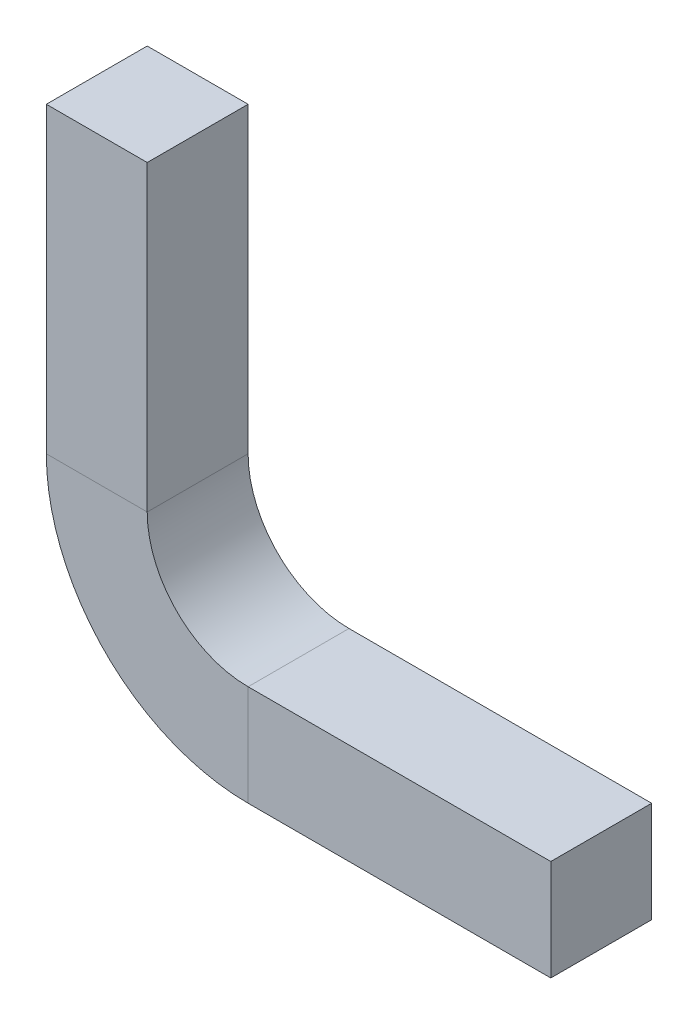
ISO-10303-21;
HEADER;
FILE_DESCRIPTION(('STEP AP214'),'2;1');
FILE_NAME('part.step','',(''),(''),'','','');
FILE_SCHEMA(('AUTOMOTIVE_DESIGN { 1 0 10303 214 1 1 1 1 }'));
ENDSEC;
DATA;
#1=APPLICATION_CONTEXT('core data for automotive mechanical design processes');
#2=APPLICATION_PROTOCOL_DEFINITION('international standard','automotive_design',2000,#1);
#3=PRODUCT_CONTEXT('',#1,'mechanical');
#4=PRODUCT('Part','Part','',(#3));
#5=PRODUCT_RELATED_PRODUCT_CATEGORY('part','',(#4));
#6=PRODUCT_DEFINITION_FORMATION('','',#4);
#7=PRODUCT_DEFINITION_CONTEXT('part definition',#1,'design');
#8=PRODUCT_DEFINITION('design','',#6,#7);
#9=PRODUCT_DEFINITION_SHAPE('','',#8);
#10=(LENGTH_UNIT() NAMED_UNIT(*) SI_UNIT(.MILLI.,.METRE.));
#11=(NAMED_UNIT(*) PLANE_ANGLE_UNIT() SI_UNIT($,.RADIAN.));
#12=(NAMED_UNIT(*) SI_UNIT($,.STERADIAN.) SOLID_ANGLE_UNIT());
#13=UNCERTAINTY_MEASURE_WITH_UNIT(LENGTH_MEASURE(1.E-05),#10,'distance_accuracy_value','');
#14=(GEOMETRIC_REPRESENTATION_CONTEXT(3) GLOBAL_UNCERTAINTY_ASSIGNED_CONTEXT((#13)) GLOBAL_UNIT_ASSIGNED_CONTEXT((#10,
#11,#12)) REPRESENTATION_CONTEXT('',''));
#15=CARTESIAN_POINT('',(0.,0.,0.));
#16=DIRECTION('',(0.,0.,1.));
#17=DIRECTION('',(1.,0.,0.));
#18=AXIS2_PLACEMENT_3D('',#15,#16,#17);
#19=CARTESIAN_POINT('',(0.,80.3218525682768,12.7));
#20=DIRECTION('',(0.,0.,1.));
#21=DIRECTION('',(0.,1.,0.));
#22=AXIS2_PLACEMENT_3D('',#19,#20,#21);
#23=PLANE('',#22);
#24=DIRECTION('',(1.,0.,0.));
#25=VECTOR('',#24,1.);
#26=CARTESIAN_POINT('',(-12.7,-12.7,12.7));
#27=LINE('',#26,#25);
#28=CARTESIAN_POINT('',(12.7,-12.7,12.7));
#29=VERTEX_POINT('',#28);
#30=CARTESIAN_POINT('',(50.8,-12.7,12.7));
#31=VERTEX_POINT('',#30);
#32=EDGE_CURVE('E159',#29,#31,#27,.T.);
#33=ORIENTED_EDGE('',*,*,#32,.T.);
#34=DIRECTION('',(0.,-1.,0.));
#35=VECTOR('',#34,1.);
#36=CARTESIAN_POINT('',(50.8,80.3218525682768,12.7));
#37=LINE('',#36,#35);
#38=CARTESIAN_POINT('',(50.8,0.,12.7));
#39=VERTEX_POINT('',#38);
#40=EDGE_CURVE('E183',#39,#31,#37,.T.);
#41=ORIENTED_EDGE('',*,*,#40,.F.);
#42=DIRECTION('',(-1.,0.,0.));
#43=VECTOR('',#42,1.);
#44=CARTESIAN_POINT('',(0.,0.,12.7));
#45=LINE('',#44,#43);
#46=CARTESIAN_POINT('',(12.7,0.,12.7));
#47=VERTEX_POINT('',#46);
#48=EDGE_CURVE('E61',#39,#47,#45,.T.);
#49=ORIENTED_EDGE('',*,*,#48,.T.);
#50=DIRECTION('',(0.,-1.,0.));
#51=VECTOR('',#50,1.);
#52=CARTESIAN_POINT('',(12.7,80.3218525682768,12.7));
#53=LINE('',#52,#51);
#54=EDGE_CURVE('E49',#47,#29,#53,.T.);
#55=ORIENTED_EDGE('',*,*,#54,.T.);
#56=EDGE_LOOP('',(#33,#41,#49,#55));
#57=FACE_BOUND('',#56,.T.);
#58=ADVANCED_FACE('F41',(#57),#23,.T.);
#59=CARTESIAN_POINT('',(50.8,80.3218525682768,12.7));
#60=DIRECTION('',(-1.,0.,0.));
#61=DIRECTION('',(0.,-1.,0.));
#62=AXIS2_PLACEMENT_3D('',#59,#60,#61);
#63=PLANE('',#62);
#64=ORIENTED_EDGE('',*,*,#40,.T.);
#65=DIRECTION('',(0.,0.,-1.));
#66=VECTOR('',#65,1.);
#67=CARTESIAN_POINT('',(50.8,-12.7,12.7));
#68=LINE('',#67,#66);
#69=CARTESIAN_POINT('',(50.8,-12.7,0.));
#70=VERTEX_POINT('',#69);
#71=EDGE_CURVE('E155',#31,#70,#68,.T.);
#72=ORIENTED_EDGE('',*,*,#71,.T.);
#73=DIRECTION('',(0.,-1.,0.));
#74=VECTOR('',#73,1.);
#75=CARTESIAN_POINT('',(50.8,80.3218525682768,0.));
#76=LINE('',#75,#74);
#77=CARTESIAN_POINT('',(50.8,0.,0.));
#78=VERTEX_POINT('',#77);
#79=EDGE_CURVE('E179',#78,#70,#76,.T.);
#80=ORIENTED_EDGE('',*,*,#79,.F.);
#81=DIRECTION('',(0.,0.,-1.));
#82=VECTOR('',#81,1.);
#83=CARTESIAN_POINT('',(50.8,0.,12.7));
#84=LINE('',#83,#82);
#85=EDGE_CURVE('E56',#39,#78,#84,.T.);
#86=ORIENTED_EDGE('',*,*,#85,.F.);
#87=EDGE_LOOP('',(#64,#72,#80,#86));
#88=FACE_BOUND('',#87,.T.);
#89=ADVANCED_FACE('F245',(#88),#63,.F.);
#90=CARTESIAN_POINT('',(0.,80.3218525682768,0.));
#91=DIRECTION('',(0.,0.,1.));
#92=DIRECTION('',(0.,1.,0.));
#93=AXIS2_PLACEMENT_3D('',#90,#91,#92);
#94=PLANE('',#93);
#95=ORIENTED_EDGE('',*,*,#79,.T.);
#96=DIRECTION('',(-1.,0.,0.));
#97=VECTOR('',#96,1.);
#98=CARTESIAN_POINT('',(0.,-12.7,0.));
#99=LINE('',#98,#97);
#100=CARTESIAN_POINT('',(12.7,-12.7,0.));
#101=VERTEX_POINT('',#100);
#102=EDGE_CURVE('E11',#70,#101,#99,.T.);
#103=ORIENTED_EDGE('',*,*,#102,.T.);
#104=DIRECTION('',(0.,-1.,0.));
#105=VECTOR('',#104,1.);
#106=CARTESIAN_POINT('',(12.7,80.3218525682768,0.));
#107=LINE('',#106,#105);
#108=CARTESIAN_POINT('',(12.7,0.,0.));
#109=VERTEX_POINT('',#108);
#110=EDGE_CURVE('E175',#109,#101,#107,.T.);
#111=ORIENTED_EDGE('',*,*,#110,.F.);
#112=DIRECTION('',(-1.,0.,0.));
#113=VECTOR('',#112,1.);
#114=CARTESIAN_POINT('',(0.,0.,0.));
#115=LINE('',#114,#113);
#116=EDGE_CURVE('E165',#78,#109,#115,.T.);
#117=ORIENTED_EDGE('',*,*,#116,.F.);
#118=EDGE_LOOP('',(#95,#103,#111,#117));
#119=FACE_BOUND('',#118,.T.);
#120=ADVANCED_FACE('F202',(#119),#94,.F.);
#121=CARTESIAN_POINT('',(0.,0.,12.7));
#122=DIRECTION('',(0.,-1.,0.));
#123=DIRECTION('',(0.,0.,-1.));
#124=AXIS2_PLACEMENT_3D('',#121,#122,#123);
#125=PLANE('',#124);
#126=ORIENTED_EDGE('',*,*,#116,.T.);
#127=DIRECTION('',(0.,0.,1.));
#128=VECTOR('',#127,1.);
#129=CARTESIAN_POINT('',(12.7,0.,12.7));
#130=LINE('',#129,#128);
#131=EDGE_CURVE('E172',#109,#47,#130,.T.);
#132=ORIENTED_EDGE('',*,*,#131,.T.);
#133=ORIENTED_EDGE('',*,*,#48,.F.);
#134=ORIENTED_EDGE('',*,*,#85,.T.);
#135=EDGE_LOOP('',(#126,#132,#133,#134));
#136=FACE_BOUND('',#135,.T.);
#137=ADVANCED_FACE('F198',(#136),#125,.F.);
#138=CARTESIAN_POINT('',(-12.7,-12.7,12.7));
#139=DIRECTION('',(0.,1.,0.));
#140=DIRECTION('',(0.,0.,1.));
#141=AXIS2_PLACEMENT_3D('',#138,#139,#140);
#142=PLANE('',#141);
#143=ORIENTED_EDGE('',*,*,#32,.F.);
#144=DIRECTION('',(0.,0.,-1.));
#145=VECTOR('',#144,1.);
#146=CARTESIAN_POINT('',(12.7,-12.7,12.7));
#147=LINE('',#146,#145);
#148=EDGE_CURVE('E126',#29,#101,#147,.T.);
#149=ORIENTED_EDGE('',*,*,#148,.T.);
#150=ORIENTED_EDGE('',*,*,#102,.F.);
#151=ORIENTED_EDGE('',*,*,#71,.F.);
#152=EDGE_LOOP('',(#143,#149,#150,#151));
#153=FACE_BOUND('',#152,.T.);
#154=ADVANCED_FACE('F242',(#153),#142,.F.);
#155=CARTESIAN_POINT('',(80.3218525682768,50.8,12.7));
#156=DIRECTION('',(0.,1.,0.));
#157=DIRECTION('',(0.,0.,1.));
#158=AXIS2_PLACEMENT_3D('',#155,#156,#157);
#159=PLANE('',#158);
#160=DIRECTION('',(0.,0.,-1.));
#161=VECTOR('',#160,1.);
#162=CARTESIAN_POINT('',(-12.7,50.8,12.7));
#163=LINE('',#162,#161);
#164=CARTESIAN_POINT('',(-12.7,50.8,12.7));
#165=VERTEX_POINT('',#164);
#166=CARTESIAN_POINT('',(-12.7,50.8,0.));
#167=VERTEX_POINT('',#166);
#168=EDGE_CURVE('E218',#165,#167,#163,.T.);
#169=ORIENTED_EDGE('',*,*,#168,.F.);
#170=DIRECTION('',(-1.,0.,0.));
#171=VECTOR('',#170,1.);
#172=CARTESIAN_POINT('',(80.3218525682768,50.8,12.7));
#173=LINE('',#172,#171);
#174=CARTESIAN_POINT('',(0.,50.8,12.7));
#175=VERTEX_POINT('',#174);
#176=EDGE_CURVE('E135',#175,#165,#173,.T.);
#177=ORIENTED_EDGE('',*,*,#176,.F.);
#178=DIRECTION('',(0.,0.,-1.));
#179=VECTOR('',#178,1.);
#180=CARTESIAN_POINT('',(0.,50.8,12.7));
#181=LINE('',#180,#179);
#182=CARTESIAN_POINT('',(0.,50.8,0.));
#183=VERTEX_POINT('',#182);
#184=EDGE_CURVE('E146',#175,#183,#181,.T.);
#185=ORIENTED_EDGE('',*,*,#184,.T.);
#186=DIRECTION('',(-1.,0.,0.));
#187=VECTOR('',#186,1.);
#188=CARTESIAN_POINT('',(80.3218525682768,50.8,0.));
#189=LINE('',#188,#187);
#190=EDGE_CURVE('E149',#183,#167,#189,.T.);
#191=ORIENTED_EDGE('',*,*,#190,.T.);
#192=EDGE_LOOP('',(#169,#177,#185,#191));
#193=FACE_BOUND('',#192,.T.);
#194=ADVANCED_FACE('F229',(#193),#159,.T.);
#195=CARTESIAN_POINT('',(0.,0.,12.7));
#196=DIRECTION('',(-1.,0.,0.));
#197=DIRECTION('',(0.,0.,1.));
#198=AXIS2_PLACEMENT_3D('',#195,#196,#197);
#199=PLANE('',#198);
#200=DIRECTION('',(0.,0.,1.));
#201=VECTOR('',#200,1.);
#202=CARTESIAN_POINT('',(0.,12.7,12.7));
#203=LINE('',#202,#201);
#204=CARTESIAN_POINT('',(0.,12.7,0.));
#205=VERTEX_POINT('',#204);
#206=CARTESIAN_POINT('',(0.,12.7,12.7));
#207=VERTEX_POINT('',#206);
#208=EDGE_CURVE('E119',#205,#207,#203,.T.);
#209=ORIENTED_EDGE('',*,*,#208,.F.);
#210=DIRECTION('',(0.,1.,0.));
#211=VECTOR('',#210,1.);
#212=CARTESIAN_POINT('',(0.,0.,0.));
#213=LINE('',#212,#211);
#214=EDGE_CURVE('E223',#205,#183,#213,.T.);
#215=ORIENTED_EDGE('',*,*,#214,.T.);
#216=ORIENTED_EDGE('',*,*,#184,.F.);
#217=DIRECTION('',(0.,1.,0.));
#218=VECTOR('',#217,1.);
#219=CARTESIAN_POINT('',(0.,0.,12.7));
#220=LINE('',#219,#218);
#221=EDGE_CURVE('E139',#207,#175,#220,.T.);
#222=ORIENTED_EDGE('',*,*,#221,.F.);
#223=EDGE_LOOP('',(#209,#215,#216,#222));
#224=FACE_BOUND('',#223,.T.);
#225=ADVANCED_FACE('F234',(#224),#199,.F.);
#226=CARTESIAN_POINT('',(80.3218525682768,0.,0.));
#227=DIRECTION('',(0.,0.,1.));
#228=DIRECTION('',(1.,0.,0.));
#229=AXIS2_PLACEMENT_3D('',#226,#227,#228);
#230=PLANE('',#229);
#231=DIRECTION('',(-1.,0.,0.));
#232=VECTOR('',#231,1.);
#233=CARTESIAN_POINT('',(80.3218525682768,12.7,0.));
#234=LINE('',#233,#232);
#235=CARTESIAN_POINT('',(-12.7,12.7,0.));
#236=VERTEX_POINT('',#235);
#237=EDGE_CURVE('E206',#205,#236,#234,.T.);
#238=ORIENTED_EDGE('',*,*,#237,.T.);
#239=DIRECTION('',(0.,-1.,0.));
#240=VECTOR('',#239,1.);
#241=CARTESIAN_POINT('',(-12.7,-12.7,0.));
#242=LINE('',#241,#240);
#243=EDGE_CURVE('E140',#167,#236,#242,.T.);
#244=ORIENTED_EDGE('',*,*,#243,.F.);
#245=ORIENTED_EDGE('',*,*,#190,.F.);
#246=ORIENTED_EDGE('',*,*,#214,.F.);
#247=EDGE_LOOP('',(#238,#244,#245,#246));
#248=FACE_BOUND('',#247,.T.);
#249=ADVANCED_FACE('F232',(#248),#230,.F.);
#250=CARTESIAN_POINT('',(-12.7,-12.7,12.7));
#251=DIRECTION('',(1.,0.,0.));
#252=DIRECTION('',(0.,0.,-1.));
#253=AXIS2_PLACEMENT_3D('',#250,#251,#252);
#254=PLANE('',#253);
#255=DIRECTION('',(0.,0.,-1.));
#256=VECTOR('',#255,1.);
#257=CARTESIAN_POINT('',(-12.7,12.7,12.7));
#258=LINE('',#257,#256);
#259=CARTESIAN_POINT('',(-12.7,12.7,12.7));
#260=VERTEX_POINT('',#259);
#261=EDGE_CURVE('E118',#260,#236,#258,.T.);
#262=ORIENTED_EDGE('',*,*,#261,.F.);
#263=DIRECTION('',(0.,-1.,0.));
#264=VECTOR('',#263,1.);
#265=CARTESIAN_POINT('',(-12.7,-12.7,12.7));
#266=LINE('',#265,#264);
#267=EDGE_CURVE('E133',#165,#260,#266,.T.);
#268=ORIENTED_EDGE('',*,*,#267,.F.);
#269=ORIENTED_EDGE('',*,*,#168,.T.);
#270=ORIENTED_EDGE('',*,*,#243,.T.);
#271=EDGE_LOOP('',(#262,#268,#269,#270));
#272=FACE_BOUND('',#271,.T.);
#273=ADVANCED_FACE('F143',(#272),#254,.F.);
#274=CARTESIAN_POINT('',(80.3218525682768,0.,12.7));
#275=DIRECTION('',(0.,0.,1.));
#276=DIRECTION('',(1.,0.,0.));
#277=AXIS2_PLACEMENT_3D('',#274,#275,#276);
#278=PLANE('',#277);
#279=ORIENTED_EDGE('',*,*,#267,.T.);
#280=DIRECTION('',(-1.,0.,0.));
#281=VECTOR('',#280,1.);
#282=CARTESIAN_POINT('',(80.3218525682768,12.7,12.7));
#283=LINE('',#282,#281);
#284=EDGE_CURVE('E106',#207,#260,#283,.T.);
#285=ORIENTED_EDGE('',*,*,#284,.F.);
#286=ORIENTED_EDGE('',*,*,#221,.T.);
#287=ORIENTED_EDGE('',*,*,#176,.T.);
#288=EDGE_LOOP('',(#279,#285,#286,#287));
#289=FACE_BOUND('',#288,.T.);
#290=ADVANCED_FACE('F134',(#289),#278,.T.);
#291=CARTESIAN_POINT('',(12.7,12.7,12.7));
#292=DIRECTION('',(0.,0.,1.));
#293=DIRECTION('',(1.,0.,0.));
#294=AXIS2_PLACEMENT_3D('',#291,#292,#293);
#295=PLANE('',#294);
#296=ORIENTED_EDGE('',*,*,#54,.F.);
#297=CARTESIAN_POINT('',(12.7,12.7,12.7));
#298=DIRECTION('',(0.,0.,-1.));
#299=DIRECTION('',(-1.,0.,0.));
#300=AXIS2_PLACEMENT_3D('',#297,#298,#299);
#301=CIRCLE('',#300,12.7);
#302=EDGE_CURVE('E112',#47,#207,#301,.T.);
#303=ORIENTED_EDGE('',*,*,#302,.T.);
#304=ORIENTED_EDGE('',*,*,#284,.T.);
#305=CARTESIAN_POINT('',(12.7,12.7,12.7));
#306=DIRECTION('',(0.,0.,-1.));
#307=DIRECTION('',(-1.,0.,0.));
#308=AXIS2_PLACEMENT_3D('',#305,#306,#307);
#309=CIRCLE('',#308,25.4);
#310=EDGE_CURVE('E109',#29,#260,#309,.T.);
#311=ORIENTED_EDGE('',*,*,#310,.F.);
#312=EDGE_LOOP('',(#296,#303,#304,#311));
#313=FACE_BOUND('',#312,.T.);
#314=ADVANCED_FACE('F108',(#313),#295,.T.);
#315=CARTESIAN_POINT('',(12.7,12.7,0.));
#316=DIRECTION('',(0.,0.,-1.));
#317=DIRECTION('',(-1.,0.,0.));
#318=AXIS2_PLACEMENT_3D('',#315,#316,#317);
#319=PLANE('',#318);
#320=CARTESIAN_POINT('',(12.7,12.7,0.));
#321=DIRECTION('',(0.,0.,-1.));
#322=DIRECTION('',(-1.,0.,0.));
#323=AXIS2_PLACEMENT_3D('',#320,#321,#322);
#324=CIRCLE('',#323,12.7);
#325=EDGE_CURVE('E129',#205,#109,#324,.F.);
#326=ORIENTED_EDGE('',*,*,#325,.T.);
#327=ORIENTED_EDGE('',*,*,#110,.T.);
#328=CARTESIAN_POINT('',(12.7,12.7,0.));
#329=DIRECTION('',(0.,0.,-1.));
#330=DIRECTION('',(-1.,0.,0.));
#331=AXIS2_PLACEMENT_3D('',#328,#329,#330);
#332=CIRCLE('',#331,25.4);
#333=EDGE_CURVE('E128',#236,#101,#332,.F.);
#334=ORIENTED_EDGE('',*,*,#333,.F.);
#335=ORIENTED_EDGE('',*,*,#237,.F.);
#336=EDGE_LOOP('',(#326,#327,#334,#335));
#337=FACE_BOUND('',#336,.T.);
#338=ADVANCED_FACE('F204',(#337),#319,.T.);
#339=CARTESIAN_POINT('',(12.7,12.7,120.332770751612));
#340=DIRECTION('',(0.,0.,-1.));
#341=DIRECTION('',(-1.,0.,0.));
#342=AXIS2_PLACEMENT_3D('',#339,#340,#341);
#343=CYLINDRICAL_SURFACE('',#342,25.4);
#344=ORIENTED_EDGE('',*,*,#261,.T.);
#345=ORIENTED_EDGE('',*,*,#333,.T.);
#346=ORIENTED_EDGE('',*,*,#148,.F.);
#347=ORIENTED_EDGE('',*,*,#310,.T.);
#348=EDGE_LOOP('',(#344,#345,#346,#347));
#349=FACE_BOUND('',#348,.T.);
#350=ADVANCED_FACE('F122',(#349),#343,.T.);
#351=CARTESIAN_POINT('',(12.7,12.7,120.332770751612));
#352=DIRECTION('',(0.,0.,-1.));
#353=DIRECTION('',(-1.,0.,0.));
#354=AXIS2_PLACEMENT_3D('',#351,#352,#353);
#355=CYLINDRICAL_SURFACE('',#354,12.7);
#356=ORIENTED_EDGE('',*,*,#208,.T.);
#357=ORIENTED_EDGE('',*,*,#302,.F.);
#358=ORIENTED_EDGE('',*,*,#131,.F.);
#359=ORIENTED_EDGE('',*,*,#325,.F.);
#360=EDGE_LOOP('',(#356,#357,#358,#359));
#361=FACE_BOUND('',#360,.T.);
#362=ADVANCED_FACE('F191',(#361),#355,.F.);
#363=CLOSED_SHELL('',(#58,#89,#120,#137,#154,#194,#225,#249,#273,#290,#314,#338,#350,#362));
#364=MANIFOLD_SOLID_BREP('B2',#363);
#365=ADVANCED_BREP_SHAPE_REPRESENTATION('',(#18,#364),#14);
#366=SHAPE_DEFINITION_REPRESENTATION(#9,#365);
ENDSEC;
END-ISO-10303-21;
